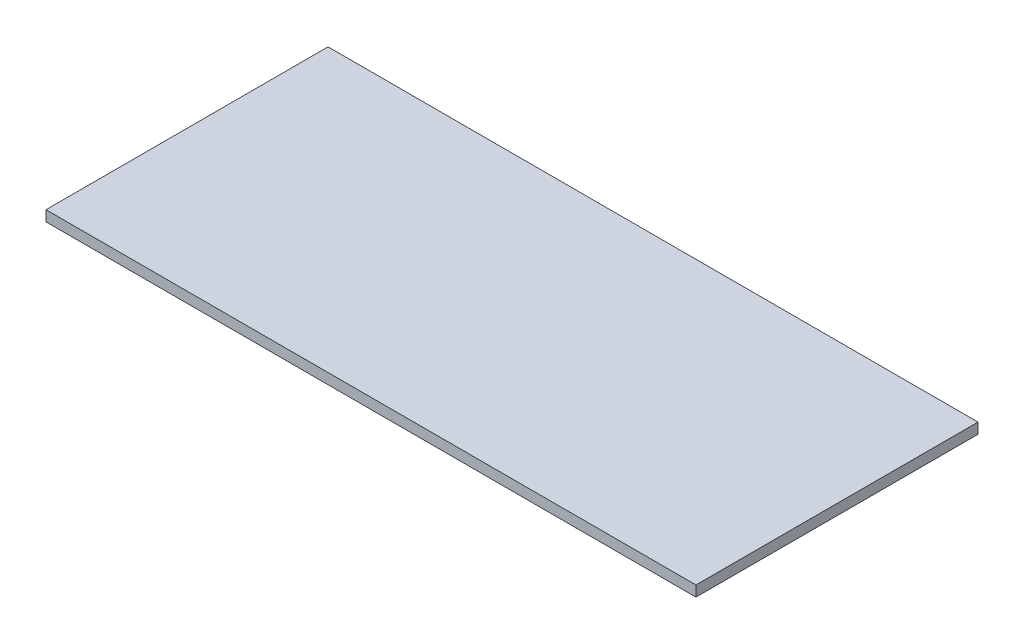
ISO-10303-21;
HEADER;
FILE_DESCRIPTION(('STEP AP214'),'2;1');
FILE_NAME('part.step','',(''),(''),'','','');
FILE_SCHEMA(('AUTOMOTIVE_DESIGN { 1 0 10303 214 1 1 1 1 }'));
ENDSEC;
DATA;
#1=APPLICATION_CONTEXT('core data for automotive mechanical design processes');
#2=APPLICATION_PROTOCOL_DEFINITION('international standard','automotive_design',2000,#1);
#3=PRODUCT_CONTEXT('',#1,'mechanical');
#4=PRODUCT('Part','Part','',(#3));
#5=PRODUCT_RELATED_PRODUCT_CATEGORY('part','',(#4));
#6=PRODUCT_DEFINITION_FORMATION('','',#4);
#7=PRODUCT_DEFINITION_CONTEXT('part definition',#1,'design');
#8=PRODUCT_DEFINITION('design','',#6,#7);
#9=PRODUCT_DEFINITION_SHAPE('','',#8);
#10=(LENGTH_UNIT() NAMED_UNIT(*) SI_UNIT(.MILLI.,.METRE.));
#11=(NAMED_UNIT(*) PLANE_ANGLE_UNIT() SI_UNIT($,.RADIAN.));
#12=(NAMED_UNIT(*) SI_UNIT($,.STERADIAN.) SOLID_ANGLE_UNIT());
#13=UNCERTAINTY_MEASURE_WITH_UNIT(LENGTH_MEASURE(1.E-05),#10,'distance_accuracy_value','');
#14=(GEOMETRIC_REPRESENTATION_CONTEXT(3) GLOBAL_UNCERTAINTY_ASSIGNED_CONTEXT((#13)) GLOBAL_UNIT_ASSIGNED_CONTEXT((#10,
#11,#12)) REPRESENTATION_CONTEXT('',''));
#15=CARTESIAN_POINT('',(0.,0.,0.));
#16=DIRECTION('',(0.,0.,1.));
#17=DIRECTION('',(1.,0.,0.));
#18=AXIS2_PLACEMENT_3D('',#15,#16,#17);
#19=CARTESIAN_POINT('',(51.5366,1.6764,-22.3647));
#20=DIRECTION('',(-1.,0.,0.));
#21=DIRECTION('',(0.,0.,1.));
#22=AXIS2_PLACEMENT_3D('',#19,#20,#21);
#23=PLANE('',#22);
#24=DIRECTION('',(0.,0.,-1.));
#25=VECTOR('',#24,1.);
#26=CARTESIAN_POINT('',(51.5366,0.,-22.3647));
#27=LINE('',#26,#25);
#28=CARTESIAN_POINT('',(51.5366,0.,22.3647));
#29=VERTEX_POINT('',#28);
#30=CARTESIAN_POINT('',(51.5366,0.,-22.3647));
#31=VERTEX_POINT('',#30);
#32=EDGE_CURVE('E95',#29,#31,#27,.T.);
#33=ORIENTED_EDGE('',*,*,#32,.T.);
#34=DIRECTION('',(0.,-1.,0.));
#35=VECTOR('',#34,1.);
#36=CARTESIAN_POINT('',(51.5366,1.6764,-22.3647));
#37=LINE('',#36,#35);
#38=CARTESIAN_POINT('',(51.5366,1.6764,-22.3647));
#39=VERTEX_POINT('',#38);
#40=EDGE_CURVE('E11',#39,#31,#37,.T.);
#41=ORIENTED_EDGE('',*,*,#40,.F.);
#42=DIRECTION('',(0.,0.,-1.));
#43=VECTOR('',#42,1.);
#44=CARTESIAN_POINT('',(51.5366,1.6764,-22.3647));
#45=LINE('',#44,#43);
#46=CARTESIAN_POINT('',(51.5366,1.6764,22.3647));
#47=VERTEX_POINT('',#46);
#48=EDGE_CURVE('E83',#47,#39,#45,.T.);
#49=ORIENTED_EDGE('',*,*,#48,.F.);
#50=DIRECTION('',(0.,-1.,0.));
#51=VECTOR('',#50,1.);
#52=CARTESIAN_POINT('',(51.5366,1.6764,22.3647));
#53=LINE('',#52,#51);
#54=EDGE_CURVE('E91',#47,#29,#53,.T.);
#55=ORIENTED_EDGE('',*,*,#54,.T.);
#56=EDGE_LOOP('',(#33,#41,#49,#55));
#57=FACE_BOUND('',#56,.T.);
#58=ADVANCED_FACE('F32',(#57),#23,.F.);
#59=CARTESIAN_POINT('',(-51.5366,1.6764,-22.3647));
#60=DIRECTION('',(0.,0.,1.));
#61=DIRECTION('',(1.,0.,0.));
#62=AXIS2_PLACEMENT_3D('',#59,#60,#61);
#63=PLANE('',#62);
#64=DIRECTION('',(-1.,0.,0.));
#65=VECTOR('',#64,1.);
#66=CARTESIAN_POINT('',(-51.5366,0.,-22.3647));
#67=LINE('',#66,#65);
#68=CARTESIAN_POINT('',(-51.5366,0.,-22.3647));
#69=VERTEX_POINT('',#68);
#70=EDGE_CURVE('E87',#31,#69,#67,.T.);
#71=ORIENTED_EDGE('',*,*,#70,.T.);
#72=DIRECTION('',(0.,-1.,0.));
#73=VECTOR('',#72,1.);
#74=CARTESIAN_POINT('',(-51.5366,1.6764,-22.3647));
#75=LINE('',#74,#73);
#76=CARTESIAN_POINT('',(-51.5366,1.6764,-22.3647));
#77=VERTEX_POINT('',#76);
#78=EDGE_CURVE('E40',#77,#69,#75,.T.);
#79=ORIENTED_EDGE('',*,*,#78,.F.);
#80=DIRECTION('',(-1.,0.,0.));
#81=VECTOR('',#80,1.);
#82=CARTESIAN_POINT('',(-51.5366,1.6764,-22.3647));
#83=LINE('',#82,#81);
#84=EDGE_CURVE('E78',#39,#77,#83,.T.);
#85=ORIENTED_EDGE('',*,*,#84,.F.);
#86=ORIENTED_EDGE('',*,*,#40,.T.);
#87=EDGE_LOOP('',(#71,#79,#85,#86));
#88=FACE_BOUND('',#87,.T.);
#89=ADVANCED_FACE('F86',(#88),#63,.F.);
#90=CARTESIAN_POINT('',(-51.5366,1.6764,-22.3647));
#91=DIRECTION('',(1.,0.,0.));
#92=DIRECTION('',(0.,0.,-1.));
#93=AXIS2_PLACEMENT_3D('',#90,#91,#92);
#94=PLANE('',#93);
#95=DIRECTION('',(0.,0.,1.));
#96=VECTOR('',#95,1.);
#97=CARTESIAN_POINT('',(-51.5366,0.,-22.3647));
#98=LINE('',#97,#96);
#99=CARTESIAN_POINT('',(-51.5366,0.,22.3647));
#100=VERTEX_POINT('',#99);
#101=EDGE_CURVE('E65',#69,#100,#98,.T.);
#102=ORIENTED_EDGE('',*,*,#101,.T.);
#103=DIRECTION('',(0.,-1.,0.));
#104=VECTOR('',#103,1.);
#105=CARTESIAN_POINT('',(-51.5366,1.6764,22.3647));
#106=LINE('',#105,#104);
#107=CARTESIAN_POINT('',(-51.5366,1.6764,22.3647));
#108=VERTEX_POINT('',#107);
#109=EDGE_CURVE('E88',#108,#100,#106,.T.);
#110=ORIENTED_EDGE('',*,*,#109,.F.);
#111=DIRECTION('',(0.,0.,1.));
#112=VECTOR('',#111,1.);
#113=CARTESIAN_POINT('',(-51.5366,1.6764,-22.3647));
#114=LINE('',#113,#112);
#115=EDGE_CURVE('E81',#77,#108,#114,.T.);
#116=ORIENTED_EDGE('',*,*,#115,.F.);
#117=ORIENTED_EDGE('',*,*,#78,.T.);
#118=EDGE_LOOP('',(#102,#110,#116,#117));
#119=FACE_BOUND('',#118,.T.);
#120=ADVANCED_FACE('F89',(#119),#94,.F.);
#121=CARTESIAN_POINT('',(-51.5366,1.6764,22.3647));
#122=DIRECTION('',(0.,0.,-1.));
#123=DIRECTION('',(-1.,0.,0.));
#124=AXIS2_PLACEMENT_3D('',#121,#122,#123);
#125=PLANE('',#124);
#126=DIRECTION('',(1.,0.,0.));
#127=VECTOR('',#126,1.);
#128=CARTESIAN_POINT('',(-51.5366,0.,22.3647));
#129=LINE('',#128,#127);
#130=EDGE_CURVE('E71',#100,#29,#129,.T.);
#131=ORIENTED_EDGE('',*,*,#130,.T.);
#132=ORIENTED_EDGE('',*,*,#54,.F.);
#133=DIRECTION('',(1.,0.,0.));
#134=VECTOR('',#133,1.);
#135=CARTESIAN_POINT('',(-51.5366,1.6764,22.3647));
#136=LINE('',#135,#134);
#137=EDGE_CURVE('E48',#108,#47,#136,.T.);
#138=ORIENTED_EDGE('',*,*,#137,.F.);
#139=ORIENTED_EDGE('',*,*,#109,.T.);
#140=EDGE_LOOP('',(#131,#132,#138,#139));
#141=FACE_BOUND('',#140,.T.);
#142=ADVANCED_FACE('F102',(#141),#125,.F.);
#143=CARTESIAN_POINT('',(0.,1.6764,0.));
#144=DIRECTION('',(0.,1.,0.));
#145=DIRECTION('',(0.,0.,1.));
#146=AXIS2_PLACEMENT_3D('',#143,#144,#145);
#147=PLANE('',#146);
#148=ORIENTED_EDGE('',*,*,#48,.T.);
#149=ORIENTED_EDGE('',*,*,#84,.T.);
#150=ORIENTED_EDGE('',*,*,#115,.T.);
#151=ORIENTED_EDGE('',*,*,#137,.T.);
#152=EDGE_LOOP('',(#148,#149,#150,#151));
#153=FACE_BOUND('',#152,.T.);
#154=ADVANCED_FACE('F79',(#153),#147,.T.);
#155=CARTESIAN_POINT('',(0.,0.,0.));
#156=DIRECTION('',(0.,1.,0.));
#157=DIRECTION('',(0.,0.,1.));
#158=AXIS2_PLACEMENT_3D('',#155,#156,#157);
#159=PLANE('',#158);
#160=ORIENTED_EDGE('',*,*,#32,.F.);
#161=ORIENTED_EDGE('',*,*,#130,.F.);
#162=ORIENTED_EDGE('',*,*,#101,.F.);
#163=ORIENTED_EDGE('',*,*,#70,.F.);
#164=EDGE_LOOP('',(#160,#161,#162,#163));
#165=FACE_BOUND('',#164,.T.);
#166=ADVANCED_FACE('F105',(#165),#159,.F.);
#167=CLOSED_SHELL('',(#58,#89,#120,#142,#154,#166));
#168=MANIFOLD_SOLID_BREP('B2',#167);
#169=ADVANCED_BREP_SHAPE_REPRESENTATION('',(#18,#168),#14);
#170=SHAPE_DEFINITION_REPRESENTATION(#9,#169);
ENDSEC;
END-ISO-10303-21;
